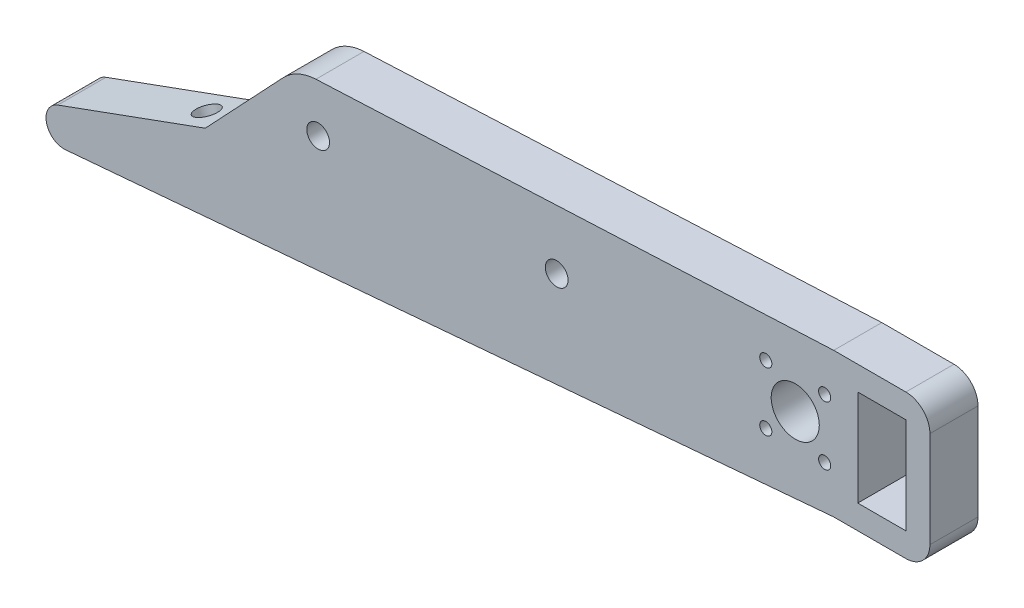
ISO-10303-21;
HEADER;
FILE_DESCRIPTION(('STEP AP214'),'2;1');
FILE_NAME('part.step','',(''),(''),'','','');
FILE_SCHEMA(('AUTOMOTIVE_DESIGN { 1 0 10303 214 1 1 1 1 }'));
ENDSEC;
DATA;
#1=APPLICATION_CONTEXT('core data for automotive mechanical design processes');
#2=APPLICATION_PROTOCOL_DEFINITION('international standard','automotive_design',2000,#1);
#3=PRODUCT_CONTEXT('',#1,'mechanical');
#4=PRODUCT('Part','Part','',(#3));
#5=PRODUCT_RELATED_PRODUCT_CATEGORY('part','',(#4));
#6=PRODUCT_DEFINITION_FORMATION('','',#4);
#7=PRODUCT_DEFINITION_CONTEXT('part definition',#1,'design');
#8=PRODUCT_DEFINITION('design','',#6,#7);
#9=PRODUCT_DEFINITION_SHAPE('','',#8);
#10=(LENGTH_UNIT() NAMED_UNIT(*) SI_UNIT(.MILLI.,.METRE.));
#11=(NAMED_UNIT(*) PLANE_ANGLE_UNIT() SI_UNIT($,.RADIAN.));
#12=(NAMED_UNIT(*) SI_UNIT($,.STERADIAN.) SOLID_ANGLE_UNIT());
#13=UNCERTAINTY_MEASURE_WITH_UNIT(LENGTH_MEASURE(1.E-05),#10,'distance_accuracy_value','');
#14=(GEOMETRIC_REPRESENTATION_CONTEXT(3) GLOBAL_UNCERTAINTY_ASSIGNED_CONTEXT((#13)) GLOBAL_UNIT_ASSIGNED_CONTEXT((#10,
#11,#12)) REPRESENTATION_CONTEXT('',''));
#15=CARTESIAN_POINT('',(0.,0.,0.));
#16=DIRECTION('',(0.,0.,1.));
#17=DIRECTION('',(1.,0.,0.));
#18=AXIS2_PLACEMENT_3D('',#15,#16,#17);
#19=CARTESIAN_POINT('',(-3.31854904900146,9.11763857748431,3.175));
#20=DIRECTION('',(0.342020143325663,-0.93969262078591,0.));
#21=DIRECTION('',(0.939692620785911,0.342020143325663,0.));
#22=AXIS2_PLACEMENT_3D('',#19,#20,#21);
#23=PLANE('',#22);
#24=CARTESIAN_POINT('',(-49.3814972545497,-7.64790347188071,0.));
#25=DIRECTION('',(-0.342020143325663,0.939692620785911,0.));
#26=DIRECTION('',(-0.939692620785911,-0.342020143325663,0.));
#27=AXIS2_PLACEMENT_3D('',#24,#25,#26);
#28=CIRCLE('',#27,1.5);
#29=CARTESIAN_POINT('',(-50.7910361857286,-8.16093368686921,0.));
#30=VERTEX_POINT('',#29);
#31=EDGE_CURVE('E541',#30,#30,#28,.T.);
#32=ORIENTED_EDGE('',*,*,#31,.F.);
#33=EDGE_LOOP('',(#32));
#34=FACE_BOUND('',#33,.T.);
#35=DIRECTION('',(-0.939692620785911,-0.342020143325663,0.));
#36=VECTOR('',#35,1.);
#37=CARTESIAN_POINT('',(-3.31854904900146,9.11763857748431,-3.175));
#38=LINE('',#37,#36);
#39=CARTESIAN_POINT('',(-46.3979731835544,-6.56198951682173,-3.175));
#40=VERTEX_POINT('',#39);
#41=CARTESIAN_POINT('',(-65.8614966392591,-13.6461327086401,-3.175));
#42=VERTEX_POINT('',#41);
#43=EDGE_CURVE('E273',#40,#42,#38,.T.);
#44=ORIENTED_EDGE('',*,*,#43,.T.);
#45=DIRECTION('',(0.,0.,-1.));
#46=VECTOR('',#45,1.);
#47=CARTESIAN_POINT('',(-65.8614966392591,-13.6461327086401,3.175));
#48=LINE('',#47,#46);
#49=CARTESIAN_POINT('',(-65.8614966392591,-13.6461327086401,3.175));
#50=VERTEX_POINT('',#49);
#51=EDGE_CURVE('E186',#50,#42,#48,.T.);
#52=ORIENTED_EDGE('',*,*,#51,.F.);
#53=DIRECTION('',(-0.939692620785911,-0.342020143325663,0.));
#54=VECTOR('',#53,1.);
#55=CARTESIAN_POINT('',(-3.31854904900146,9.11763857748431,3.175));
#56=LINE('',#55,#54);
#57=CARTESIAN_POINT('',(-46.3979731835544,-6.56198951682173,3.175));
#58=VERTEX_POINT('',#57);
#59=EDGE_CURVE('E287',#58,#50,#56,.T.);
#60=ORIENTED_EDGE('',*,*,#59,.F.);
#61=DIRECTION('',(0.,0.,-1.));
#62=VECTOR('',#61,1.);
#63=CARTESIAN_POINT('',(-46.3979731835544,-6.56198951682173,3.175));
#64=LINE('',#63,#62);
#65=EDGE_CURVE('E174',#58,#40,#64,.T.);
#66=ORIENTED_EDGE('',*,*,#65,.T.);
#67=EDGE_LOOP('',(#44,#52,#60,#66));
#68=FACE_BOUND('',#67,.T.);
#69=ADVANCED_FACE('F37',(#34,#68),#23,.F.);
#70=CARTESIAN_POINT('',(-65.0470611729648,-15.8837757618866,3.175));
#71=DIRECTION('',(0.,0.,-1.));
#72=DIRECTION('',(-1.,0.,0.));
#73=AXIS2_PLACEMENT_3D('',#70,#71,#72);
#74=CYLINDRICAL_SURFACE('',#73,2.38125);
#75=CARTESIAN_POINT('',(-65.0470611729648,-15.8837757618866,-3.175));
#76=DIRECTION('',(0.,0.,1.));
#77=DIRECTION('',(1.,0.,0.));
#78=AXIS2_PLACEMENT_3D('',#75,#76,#77);
#79=CIRCLE('',#78,2.38125);
#80=CARTESIAN_POINT('',(-64.8428124226916,-18.25625,-3.175));
#81=VERTEX_POINT('',#80);
#82=EDGE_CURVE('E222',#42,#81,#79,.T.);
#83=ORIENTED_EDGE('',*,*,#82,.T.);
#84=DIRECTION('',(0.,0.,-1.));
#85=VECTOR('',#84,1.);
#86=CARTESIAN_POINT('',(-64.8428124226916,-18.25625,3.175));
#87=LINE('',#86,#85);
#88=CARTESIAN_POINT('',(-64.8428124226916,-18.25625,3.175));
#89=VERTEX_POINT('',#88);
#90=EDGE_CURVE('E243',#89,#81,#87,.T.);
#91=ORIENTED_EDGE('',*,*,#90,.F.);
#92=CARTESIAN_POINT('',(-65.0470611729648,-15.8837757618866,3.175));
#93=DIRECTION('',(0.,0.,1.));
#94=DIRECTION('',(1.,0.,0.));
#95=AXIS2_PLACEMENT_3D('',#92,#93,#94);
#96=CIRCLE('',#95,2.38125);
#97=EDGE_CURVE('E284',#50,#89,#96,.T.);
#98=ORIENTED_EDGE('',*,*,#97,.F.);
#99=ORIENTED_EDGE('',*,*,#51,.T.);
#100=EDGE_LOOP('',(#83,#91,#98,#99));
#101=FACE_BOUND('',#100,.T.);
#102=ADVANCED_FACE('F277',(#101),#74,.T.);
#103=CARTESIAN_POINT('',(1.08307871550591,-12.5806221430956,3.175));
#104=DIRECTION('',(-0.0857737533955733,0.99631464067755,0.));
#105=DIRECTION('',(-0.99631464067755,-0.0857737533955733,0.));
#106=AXIS2_PLACEMENT_3D('',#103,#104,#105);
#107=PLANE('',#106);
#108=DIRECTION('',(0.99631464067755,0.0857737533955733,0.));
#109=VECTOR('',#108,1.);
#110=CARTESIAN_POINT('',(1.08307871550591,-12.5806221430956,-3.175));
#111=LINE('',#110,#109);
#112=CARTESIAN_POINT('',(36.576,-9.525,-3.175));
#113=VERTEX_POINT('',#112);
#114=EDGE_CURVE('E218',#81,#113,#111,.T.);
#115=ORIENTED_EDGE('',*,*,#114,.T.);
#116=DIRECTION('',(0.,0.,-1.));
#117=VECTOR('',#116,1.);
#118=CARTESIAN_POINT('',(36.576,-9.525,3.175));
#119=LINE('',#118,#117);
#120=CARTESIAN_POINT('',(36.576,-9.525,3.175));
#121=VERTEX_POINT('',#120);
#122=EDGE_CURVE('E217',#121,#113,#119,.T.);
#123=ORIENTED_EDGE('',*,*,#122,.F.);
#124=DIRECTION('',(0.99631464067755,0.0857737533955733,0.));
#125=VECTOR('',#124,1.);
#126=CARTESIAN_POINT('',(1.08307871550591,-12.5806221430956,3.175));
#127=LINE('',#126,#125);
#128=EDGE_CURVE('E283',#89,#121,#127,.T.);
#129=ORIENTED_EDGE('',*,*,#128,.F.);
#130=ORIENTED_EDGE('',*,*,#90,.T.);
#131=EDGE_LOOP('',(#115,#123,#129,#130));
#132=FACE_BOUND('',#131,.T.);
#133=ADVANCED_FACE('F282',(#132),#107,.F.);
#134=CARTESIAN_POINT('',(0.,-9.52500000000001,3.175));
#135=DIRECTION('',(0.,1.,0.));
#136=DIRECTION('',(-1.,0.,0.));
#137=AXIS2_PLACEMENT_3D('',#134,#135,#136);
#138=PLANE('',#137);
#139=DIRECTION('',(1.,0.,0.));
#140=VECTOR('',#139,1.);
#141=CARTESIAN_POINT('',(0.,-9.52500000000001,-3.175));
#142=LINE('',#141,#140);
#143=CARTESIAN_POINT('',(46.101,-9.525,-3.175));
#144=VERTEX_POINT('',#143);
#145=EDGE_CURVE('E212',#113,#144,#142,.T.);
#146=ORIENTED_EDGE('',*,*,#145,.T.);
#147=DIRECTION('',(0.,0.,-1.));
#148=VECTOR('',#147,1.);
#149=CARTESIAN_POINT('',(46.101,-9.525,3.175));
#150=LINE('',#149,#148);
#151=CARTESIAN_POINT('',(46.101,-9.525,3.175));
#152=VERTEX_POINT('',#151);
#153=EDGE_CURVE('E60',#144,#152,#150,.F.);
#154=ORIENTED_EDGE('',*,*,#153,.T.);
#155=DIRECTION('',(1.,0.,0.));
#156=VECTOR('',#155,1.);
#157=CARTESIAN_POINT('',(0.,-9.52500000000001,3.175));
#158=LINE('',#157,#156);
#159=EDGE_CURVE('E197',#121,#152,#158,.T.);
#160=ORIENTED_EDGE('',*,*,#159,.F.);
#161=ORIENTED_EDGE('',*,*,#122,.T.);
#162=EDGE_LOOP('',(#146,#154,#160,#161));
#163=FACE_BOUND('',#162,.T.);
#164=ADVANCED_FACE('F215',(#163),#138,.F.);
#165=CARTESIAN_POINT('',(49.276,0.,3.175));
#166=DIRECTION('',(1.,0.,0.));
#167=DIRECTION('',(0.,0.,-1.));
#168=AXIS2_PLACEMENT_3D('',#165,#166,#167);
#169=PLANE('',#168);
#170=DIRECTION('',(0.,-1.,0.));
#171=VECTOR('',#170,1.);
#172=CARTESIAN_POINT('',(49.276,0.,3.175));
#173=LINE('',#172,#171);
#174=CARTESIAN_POINT('',(49.276,6.35,3.175));
#175=VERTEX_POINT('',#174);
#176=CARTESIAN_POINT('',(49.276,-6.35,3.175));
#177=VERTEX_POINT('',#176);
#178=EDGE_CURVE('E196',#175,#177,#173,.T.);
#179=ORIENTED_EDGE('',*,*,#178,.T.);
#180=DIRECTION('',(0.,0.,-1.));
#181=VECTOR('',#180,1.);
#182=CARTESIAN_POINT('',(49.276,-6.35,-3.175));
#183=LINE('',#182,#181);
#184=CARTESIAN_POINT('',(49.276,-6.35,-3.175));
#185=VERTEX_POINT('',#184);
#186=EDGE_CURVE('E185',#177,#185,#183,.T.);
#187=ORIENTED_EDGE('',*,*,#186,.T.);
#188=DIRECTION('',(0.,-1.,0.));
#189=VECTOR('',#188,1.);
#190=CARTESIAN_POINT('',(49.276,0.,-3.175));
#191=LINE('',#190,#189);
#192=CARTESIAN_POINT('',(49.276,6.35,-3.175));
#193=VERTEX_POINT('',#192);
#194=EDGE_CURVE('E213',#193,#185,#191,.T.);
#195=ORIENTED_EDGE('',*,*,#194,.F.);
#196=DIRECTION('',(0.,0.,-1.));
#197=VECTOR('',#196,1.);
#198=CARTESIAN_POINT('',(49.276,6.35,3.175));
#199=LINE('',#198,#197);
#200=EDGE_CURVE('E183',#193,#175,#199,.F.);
#201=ORIENTED_EDGE('',*,*,#200,.T.);
#202=EDGE_LOOP('',(#179,#187,#195,#201));
#203=FACE_BOUND('',#202,.T.);
#204=ADVANCED_FACE('F201',(#203),#169,.T.);
#205=CARTESIAN_POINT('',(0.,9.525,3.175));
#206=DIRECTION('',(0.,1.,0.));
#207=DIRECTION('',(0.,0.,1.));
#208=AXIS2_PLACEMENT_3D('',#205,#206,#207);
#209=PLANE('',#208);
#210=DIRECTION('',(1.,0.,0.));
#211=VECTOR('',#210,1.);
#212=CARTESIAN_POINT('',(0.,9.525,3.175));
#213=LINE('',#212,#211);
#214=CARTESIAN_POINT('',(36.576,9.525,3.175));
#215=VERTEX_POINT('',#214);
#216=CARTESIAN_POINT('',(46.101,9.525,3.175));
#217=VERTEX_POINT('',#216);
#218=EDGE_CURVE('E205',#215,#217,#213,.T.);
#219=ORIENTED_EDGE('',*,*,#218,.T.);
#220=DIRECTION('',(0.,0.,-1.));
#221=VECTOR('',#220,1.);
#222=CARTESIAN_POINT('',(46.101,9.525,3.175));
#223=LINE('',#222,#221);
#224=CARTESIAN_POINT('',(46.101,9.525,-3.175));
#225=VERTEX_POINT('',#224);
#226=EDGE_CURVE('E11',#217,#225,#223,.T.);
#227=ORIENTED_EDGE('',*,*,#226,.T.);
#228=DIRECTION('',(1.,0.,0.));
#229=VECTOR('',#228,1.);
#230=CARTESIAN_POINT('',(0.,9.525,-3.175));
#231=LINE('',#230,#229);
#232=CARTESIAN_POINT('',(36.576,9.525,-3.175));
#233=VERTEX_POINT('',#232);
#234=EDGE_CURVE('E220',#233,#225,#231,.T.);
#235=ORIENTED_EDGE('',*,*,#234,.F.);
#236=DIRECTION('',(0.,0.,-1.));
#237=VECTOR('',#236,1.);
#238=CARTESIAN_POINT('',(36.576,9.525,3.175));
#239=LINE('',#238,#237);
#240=EDGE_CURVE('E240',#215,#233,#239,.T.);
#241=ORIENTED_EDGE('',*,*,#240,.F.);
#242=EDGE_LOOP('',(#219,#227,#235,#241));
#243=FACE_BOUND('',#242,.T.);
#244=ADVANCED_FACE('F364',(#243),#209,.T.);
#245=CARTESIAN_POINT('',(-0.363289023984433,7.80581529648143,3.175));
#246=DIRECTION('',(0.046490494272575,-0.998918732401336,0.));
#247=DIRECTION('',(0.998918732401336,0.046490494272575,0.));
#248=AXIS2_PLACEMENT_3D('',#245,#246,#247);
#249=PLANE('',#248);
#250=DIRECTION('',(-0.998918732401336,-0.046490494272575,0.));
#251=VECTOR('',#250,1.);
#252=CARTESIAN_POINT('',(-0.363289023984433,7.80581529648143,-3.175));
#253=LINE('',#252,#251);
#254=CARTESIAN_POINT('',(-31.7912146386308,6.34313395074848,-3.175));
#255=VERTEX_POINT('',#254);
#256=EDGE_CURVE('E228',#233,#255,#253,.T.);
#257=ORIENTED_EDGE('',*,*,#256,.T.);
#258=DIRECTION('',(0.,0.,-1.));
#259=VECTOR('',#258,1.);
#260=CARTESIAN_POINT('',(-31.7912146386308,6.34313395074848,3.175));
#261=LINE('',#260,#259);
#262=CARTESIAN_POINT('',(-31.7912146386308,6.34313395074848,3.175));
#263=VERTEX_POINT('',#262);
#264=EDGE_CURVE('E237',#263,#255,#261,.T.);
#265=ORIENTED_EDGE('',*,*,#264,.F.);
#266=DIRECTION('',(-0.998918732401336,-0.046490494272575,0.));
#267=VECTOR('',#266,1.);
#268=CARTESIAN_POINT('',(-0.363289023984433,7.80581529648143,3.175));
#269=LINE('',#268,#267);
#270=EDGE_CURVE('E292',#215,#263,#269,.T.);
#271=ORIENTED_EDGE('',*,*,#270,.F.);
#272=ORIENTED_EDGE('',*,*,#240,.T.);
#273=EDGE_LOOP('',(#257,#265,#271,#272));
#274=FACE_BOUND('',#273,.T.);
#275=ADVANCED_FACE('F358',(#274),#249,.F.);
#276=CARTESIAN_POINT('',(-31.496,0.,3.175));
#277=DIRECTION('',(0.,0.,-1.));
#278=DIRECTION('',(-1.,0.,0.));
#279=AXIS2_PLACEMENT_3D('',#276,#277,#278);
#280=CYLINDRICAL_SURFACE('',#279,6.35);
#281=CARTESIAN_POINT('',(-31.496,0.,-3.175));
#282=DIRECTION('',(0.,0.,1.));
#283=DIRECTION('',(1.,0.,0.));
#284=AXIS2_PLACEMENT_3D('',#281,#282,#283);
#285=CIRCLE('',#284,6.35);
#286=CARTESIAN_POINT('',(-36.1188329423087,4.35337978902663,-3.175));
#287=VERTEX_POINT('',#286);
#288=EDGE_CURVE('E230',#255,#287,#285,.T.);
#289=ORIENTED_EDGE('',*,*,#288,.T.);
#290=DIRECTION('',(0.,0.,-1.));
#291=VECTOR('',#290,1.);
#292=CARTESIAN_POINT('',(-36.1188329423087,4.35337978902663,3.175));
#293=LINE('',#292,#291);
#294=CARTESIAN_POINT('',(-36.1188329423087,4.35337978902663,3.175));
#295=VERTEX_POINT('',#294);
#296=EDGE_CURVE('E177',#295,#287,#293,.T.);
#297=ORIENTED_EDGE('',*,*,#296,.F.);
#298=CARTESIAN_POINT('',(-31.496,0.,3.175));
#299=DIRECTION('',(0.,0.,1.));
#300=DIRECTION('',(1.,0.,0.));
#301=AXIS2_PLACEMENT_3D('',#298,#299,#300);
#302=CIRCLE('',#301,6.35);
#303=EDGE_CURVE('E294',#263,#295,#302,.T.);
#304=ORIENTED_EDGE('',*,*,#303,.F.);
#305=ORIENTED_EDGE('',*,*,#264,.T.);
#306=EDGE_LOOP('',(#289,#297,#304,#305));
#307=FACE_BOUND('',#306,.T.);
#308=ADVANCED_FACE('F354',(#307),#280,.T.);
#309=CARTESIAN_POINT('',(0.,6.35,3.175));
#310=DIRECTION('',(0.,1.,0.));
#311=DIRECTION('',(0.,0.,1.));
#312=AXIS2_PLACEMENT_3D('',#309,#310,#311);
#313=PLANE('',#312);
#314=DIRECTION('',(1.,0.,0.));
#315=VECTOR('',#314,1.);
#316=CARTESIAN_POINT('',(0.,6.35,-3.175));
#317=LINE('',#316,#315);
#318=CARTESIAN_POINT('',(39.751,6.35,-3.175));
#319=VERTEX_POINT('',#318);
#320=CARTESIAN_POINT('',(46.101,6.35,-3.175));
#321=VERTEX_POINT('',#320);
#322=EDGE_CURVE('E173',#319,#321,#317,.T.);
#323=ORIENTED_EDGE('',*,*,#322,.T.);
#324=DIRECTION('',(0.,0.,-1.));
#325=VECTOR('',#324,1.);
#326=CARTESIAN_POINT('',(46.101,6.35,3.175));
#327=LINE('',#326,#325);
#328=CARTESIAN_POINT('',(46.101,6.35,3.175));
#329=VERTEX_POINT('',#328);
#330=EDGE_CURVE('E153',#329,#321,#327,.T.);
#331=ORIENTED_EDGE('',*,*,#330,.F.);
#332=DIRECTION('',(1.,0.,0.));
#333=VECTOR('',#332,1.);
#334=CARTESIAN_POINT('',(0.,6.35,3.175));
#335=LINE('',#334,#333);
#336=CARTESIAN_POINT('',(39.751,6.35,3.175));
#337=VERTEX_POINT('',#336);
#338=EDGE_CURVE('E160',#337,#329,#335,.T.);
#339=ORIENTED_EDGE('',*,*,#338,.F.);
#340=DIRECTION('',(0.,0.,-1.));
#341=VECTOR('',#340,1.);
#342=CARTESIAN_POINT('',(39.751,6.35,3.175));
#343=LINE('',#342,#341);
#344=EDGE_CURVE('E248',#337,#319,#343,.T.);
#345=ORIENTED_EDGE('',*,*,#344,.T.);
#346=EDGE_LOOP('',(#323,#331,#339,#345));
#347=FACE_BOUND('',#346,.T.);
#348=ADVANCED_FACE('F171',(#347),#313,.F.);
#349=CARTESIAN_POINT('',(46.101,0.,3.175));
#350=DIRECTION('',(1.,0.,0.));
#351=DIRECTION('',(0.,0.,-1.));
#352=AXIS2_PLACEMENT_3D('',#349,#350,#351);
#353=PLANE('',#352);
#354=DIRECTION('',(0.,-1.,0.));
#355=VECTOR('',#354,1.);
#356=CARTESIAN_POINT('',(46.101,0.,-3.175));
#357=LINE('',#356,#355);
#358=CARTESIAN_POINT('',(46.101,-6.35,-3.175));
#359=VERTEX_POINT('',#358);
#360=EDGE_CURVE('E261',#321,#359,#357,.T.);
#361=ORIENTED_EDGE('',*,*,#360,.T.);
#362=DIRECTION('',(0.,0.,-1.));
#363=VECTOR('',#362,1.);
#364=CARTESIAN_POINT('',(46.101,-6.35,3.175));
#365=LINE('',#364,#363);
#366=CARTESIAN_POINT('',(46.101,-6.35,3.175));
#367=VERTEX_POINT('',#366);
#368=EDGE_CURVE('E155',#367,#359,#365,.T.);
#369=ORIENTED_EDGE('',*,*,#368,.F.);
#370=DIRECTION('',(0.,-1.,0.));
#371=VECTOR('',#370,1.);
#372=CARTESIAN_POINT('',(46.101,0.,3.175));
#373=LINE('',#372,#371);
#374=EDGE_CURVE('E148',#329,#367,#373,.T.);
#375=ORIENTED_EDGE('',*,*,#374,.F.);
#376=ORIENTED_EDGE('',*,*,#330,.T.);
#377=EDGE_LOOP('',(#361,#369,#375,#376));
#378=FACE_BOUND('',#377,.T.);
#379=ADVANCED_FACE('F151',(#378),#353,.F.);
#380=CARTESIAN_POINT('',(0.,-6.34999999999999,3.175));
#381=DIRECTION('',(0.,1.,0.));
#382=DIRECTION('',(-1.,0.,0.));
#383=AXIS2_PLACEMENT_3D('',#380,#381,#382);
#384=PLANE('',#383);
#385=DIRECTION('',(1.,0.,0.));
#386=VECTOR('',#385,1.);
#387=CARTESIAN_POINT('',(0.,-6.34999999999999,-3.175));
#388=LINE('',#387,#386);
#389=CARTESIAN_POINT('',(39.751,-6.35,-3.175));
#390=VERTEX_POINT('',#389);
#391=EDGE_CURVE('E258',#390,#359,#388,.T.);
#392=ORIENTED_EDGE('',*,*,#391,.F.);
#393=DIRECTION('',(0.,0.,-1.));
#394=VECTOR('',#393,1.);
#395=CARTESIAN_POINT('',(39.751,-6.35,3.175));
#396=LINE('',#395,#394);
#397=CARTESIAN_POINT('',(39.751,-6.35,3.175));
#398=VERTEX_POINT('',#397);
#399=EDGE_CURVE('E179',#398,#390,#396,.T.);
#400=ORIENTED_EDGE('',*,*,#399,.F.);
#401=DIRECTION('',(1.,0.,0.));
#402=VECTOR('',#401,1.);
#403=CARTESIAN_POINT('',(0.,-6.34999999999999,3.175));
#404=LINE('',#403,#402);
#405=EDGE_CURVE('E159',#398,#367,#404,.T.);
#406=ORIENTED_EDGE('',*,*,#405,.T.);
#407=ORIENTED_EDGE('',*,*,#368,.T.);
#408=EDGE_LOOP('',(#392,#400,#406,#407));
#409=FACE_BOUND('',#408,.T.);
#410=ADVANCED_FACE('F259',(#409),#384,.T.);
#411=CARTESIAN_POINT('',(27.606912703474,-3.88908729652599,3.175));
#412=DIRECTION('',(0.,0.,-1.));
#413=DIRECTION('',(-1.,0.,0.));
#414=AXIS2_PLACEMENT_3D('',#411,#412,#413);
#415=CYLINDRICAL_SURFACE('',#414,0.800000000000003);
#416=CARTESIAN_POINT('',(27.606912703474,-3.88908729652599,3.175));
#417=DIRECTION('',(0.,0.,1.));
#418=DIRECTION('',(1.,0.,0.));
#419=AXIS2_PLACEMENT_3D('',#416,#417,#418);
#420=CIRCLE('',#419,0.800000000000003);
#421=CARTESIAN_POINT('',(28.406912703474,-3.88908729652599,3.175));
#422=VERTEX_POINT('',#421);
#423=EDGE_CURVE('E563',#422,#422,#420,.T.);
#424=ORIENTED_EDGE('',*,*,#423,.T.);
#425=EDGE_LOOP('',(#424));
#426=FACE_BOUND('',#425,.T.);
#427=CARTESIAN_POINT('',(27.606912703474,-3.88908729652599,-3.175));
#428=DIRECTION('',(0.,0.,1.));
#429=DIRECTION('',(1.,0.,0.));
#430=AXIS2_PLACEMENT_3D('',#427,#428,#429);
#431=CIRCLE('',#430,0.800000000000003);
#432=CARTESIAN_POINT('',(28.406912703474,-3.88908729652599,-3.175));
#433=VERTEX_POINT('',#432);
#434=EDGE_CURVE('E267',#433,#433,#431,.T.);
#435=ORIENTED_EDGE('',*,*,#434,.F.);
#436=EDGE_LOOP('',(#435));
#437=FACE_BOUND('',#436,.T.);
#438=ADVANCED_FACE('F343',(#426,#437),#415,.F.);
#439=CARTESIAN_POINT('',(35.385087296526,3.88908729652601,3.175));
#440=DIRECTION('',(0.,0.,-1.));
#441=DIRECTION('',(-1.,0.,0.));
#442=AXIS2_PLACEMENT_3D('',#439,#440,#441);
#443=CYLINDRICAL_SURFACE('',#442,0.80000000000001);
#444=CARTESIAN_POINT('',(35.385087296526,3.88908729652601,3.175));
#445=DIRECTION('',(0.,0.,1.));
#446=DIRECTION('',(1.,0.,0.));
#447=AXIS2_PLACEMENT_3D('',#444,#445,#446);
#448=CIRCLE('',#447,0.80000000000001);
#449=CARTESIAN_POINT('',(36.185087296526,3.88908729652601,3.175));
#450=VERTEX_POINT('',#449);
#451=EDGE_CURVE('E560',#450,#450,#448,.T.);
#452=ORIENTED_EDGE('',*,*,#451,.T.);
#453=EDGE_LOOP('',(#452));
#454=FACE_BOUND('',#453,.T.);
#455=CARTESIAN_POINT('',(35.385087296526,3.88908729652601,-3.175));
#456=DIRECTION('',(0.,0.,1.));
#457=DIRECTION('',(1.,0.,0.));
#458=AXIS2_PLACEMENT_3D('',#455,#456,#457);
#459=CIRCLE('',#458,0.80000000000001);
#460=CARTESIAN_POINT('',(36.185087296526,3.88908729652601,-3.175));
#461=VERTEX_POINT('',#460);
#462=EDGE_CURVE('E264',#461,#461,#459,.T.);
#463=ORIENTED_EDGE('',*,*,#462,.F.);
#464=EDGE_LOOP('',(#463));
#465=FACE_BOUND('',#464,.T.);
#466=ADVANCED_FACE('F328',(#454,#465),#443,.F.);
#467=CARTESIAN_POINT('',(39.751,0.,3.175));
#468=DIRECTION('',(1.,0.,0.));
#469=DIRECTION('',(0.,0.,-1.));
#470=AXIS2_PLACEMENT_3D('',#467,#468,#469);
#471=PLANE('',#470);
#472=DIRECTION('',(0.,-1.,0.));
#473=VECTOR('',#472,1.);
#474=CARTESIAN_POINT('',(39.751,0.,-3.175));
#475=LINE('',#474,#473);
#476=EDGE_CURVE('E255',#319,#390,#475,.T.);
#477=ORIENTED_EDGE('',*,*,#476,.F.);
#478=ORIENTED_EDGE('',*,*,#344,.F.);
#479=DIRECTION('',(0.,-1.,0.));
#480=VECTOR('',#479,1.);
#481=CARTESIAN_POINT('',(39.751,0.,3.175));
#482=LINE('',#481,#480);
#483=EDGE_CURVE('E167',#337,#398,#482,.T.);
#484=ORIENTED_EDGE('',*,*,#483,.T.);
#485=ORIENTED_EDGE('',*,*,#399,.T.);
#486=EDGE_LOOP('',(#477,#478,#484,#485));
#487=FACE_BOUND('',#486,.T.);
#488=ADVANCED_FACE('F253',(#487),#471,.T.);
#489=CARTESIAN_POINT('',(31.496,0.,3.175));
#490=DIRECTION('',(0.,0.,-1.));
#491=DIRECTION('',(-1.,0.,0.));
#492=AXIS2_PLACEMENT_3D('',#489,#490,#491);
#493=CYLINDRICAL_SURFACE('',#492,3.17500000000001);
#494=CARTESIAN_POINT('',(31.496,0.,3.175));
#495=DIRECTION('',(0.,0.,1.));
#496=DIRECTION('',(1.,0.,0.));
#497=AXIS2_PLACEMENT_3D('',#494,#495,#496);
#498=CIRCLE('',#497,3.17500000000001);
#499=CARTESIAN_POINT('',(34.671,0.,3.175));
#500=VERTEX_POINT('',#499);
#501=EDGE_CURVE('E169',#500,#500,#498,.T.);
#502=ORIENTED_EDGE('',*,*,#501,.T.);
#503=EDGE_LOOP('',(#502));
#504=FACE_BOUND('',#503,.T.);
#505=CARTESIAN_POINT('',(31.496,0.,-3.175));
#506=DIRECTION('',(0.,0.,1.));
#507=DIRECTION('',(1.,0.,0.));
#508=AXIS2_PLACEMENT_3D('',#505,#506,#507);
#509=CIRCLE('',#508,3.17500000000001);
#510=CARTESIAN_POINT('',(34.671,0.,-3.175));
#511=VERTEX_POINT('',#510);
#512=EDGE_CURVE('E310',#511,#511,#509,.T.);
#513=ORIENTED_EDGE('',*,*,#512,.F.);
#514=EDGE_LOOP('',(#513));
#515=FACE_BOUND('',#514,.T.);
#516=ADVANCED_FACE('F316',(#504,#515),#493,.F.);
#517=CARTESIAN_POINT('',(27.606912703474,3.88908729652603,3.175));
#518=DIRECTION('',(0.,0.,-1.));
#519=DIRECTION('',(-1.,0.,0.));
#520=AXIS2_PLACEMENT_3D('',#517,#518,#519);
#521=CYLINDRICAL_SURFACE('',#520,0.800000000000003);
#522=CARTESIAN_POINT('',(27.606912703474,3.88908729652603,3.175));
#523=DIRECTION('',(0.,0.,1.));
#524=DIRECTION('',(1.,0.,0.));
#525=AXIS2_PLACEMENT_3D('',#522,#523,#524);
#526=CIRCLE('',#525,0.800000000000003);
#527=CARTESIAN_POINT('',(28.406912703474,3.88908729652603,3.175));
#528=VERTEX_POINT('',#527);
#529=EDGE_CURVE('E554',#528,#528,#526,.T.);
#530=ORIENTED_EDGE('',*,*,#529,.T.);
#531=EDGE_LOOP('',(#530));
#532=FACE_BOUND('',#531,.T.);
#533=CARTESIAN_POINT('',(27.606912703474,3.88908729652603,-3.175));
#534=DIRECTION('',(0.,0.,1.));
#535=DIRECTION('',(1.,0.,0.));
#536=AXIS2_PLACEMENT_3D('',#533,#534,#535);
#537=CIRCLE('',#536,0.800000000000003);
#538=CARTESIAN_POINT('',(28.406912703474,3.88908729652603,-3.175));
#539=VERTEX_POINT('',#538);
#540=EDGE_CURVE('E307',#539,#539,#537,.T.);
#541=ORIENTED_EDGE('',*,*,#540,.F.);
#542=EDGE_LOOP('',(#541));
#543=FACE_BOUND('',#542,.T.);
#544=ADVANCED_FACE('F318',(#532,#543),#521,.F.);
#545=CARTESIAN_POINT('',(35.385087296526,-3.88908729652601,3.175));
#546=DIRECTION('',(0.,0.,-1.));
#547=DIRECTION('',(-1.,0.,0.));
#548=AXIS2_PLACEMENT_3D('',#545,#546,#547);
#549=CYLINDRICAL_SURFACE('',#548,0.800000000000003);
#550=CARTESIAN_POINT('',(35.385087296526,-3.88908729652601,3.175));
#551=DIRECTION('',(0.,0.,1.));
#552=DIRECTION('',(1.,0.,0.));
#553=AXIS2_PLACEMENT_3D('',#550,#551,#552);
#554=CIRCLE('',#553,0.800000000000003);
#555=CARTESIAN_POINT('',(36.185087296526,-3.88908729652601,3.175));
#556=VERTEX_POINT('',#555);
#557=EDGE_CURVE('E551',#556,#556,#554,.T.);
#558=ORIENTED_EDGE('',*,*,#557,.T.);
#559=EDGE_LOOP('',(#558));
#560=FACE_BOUND('',#559,.T.);
#561=CARTESIAN_POINT('',(35.385087296526,-3.88908729652601,-3.175));
#562=DIRECTION('',(0.,0.,1.));
#563=DIRECTION('',(1.,0.,0.));
#564=AXIS2_PLACEMENT_3D('',#561,#562,#563);
#565=CIRCLE('',#564,0.800000000000003);
#566=CARTESIAN_POINT('',(36.185087296526,-3.88908729652601,-3.175));
#567=VERTEX_POINT('',#566);
#568=EDGE_CURVE('E304',#567,#567,#565,.T.);
#569=ORIENTED_EDGE('',*,*,#568,.F.);
#570=EDGE_LOOP('',(#569));
#571=FACE_BOUND('',#570,.T.);
#572=ADVANCED_FACE('F325',(#560,#571),#549,.F.);
#573=CARTESIAN_POINT('',(-31.496,0.,3.175));
#574=DIRECTION('',(0.,0.,-1.));
#575=DIRECTION('',(-1.,0.,0.));
#576=AXIS2_PLACEMENT_3D('',#573,#574,#575);
#577=CYLINDRICAL_SURFACE('',#576,1.499997);
#578=CARTESIAN_POINT('',(-31.496,0.,3.175));
#579=DIRECTION('',(0.,0.,1.));
#580=DIRECTION('',(1.,0.,0.));
#581=AXIS2_PLACEMENT_3D('',#578,#579,#580);
#582=CIRCLE('',#581,1.499997);
#583=CARTESIAN_POINT('',(-29.996003,0.,3.175));
#584=VERTEX_POINT('',#583);
#585=EDGE_CURVE('E548',#584,#584,#582,.F.);
#586=ORIENTED_EDGE('',*,*,#585,.F.);
#587=EDGE_LOOP('',(#586));
#588=FACE_BOUND('',#587,.T.);
#589=CARTESIAN_POINT('',(-31.496,0.,-3.175));
#590=DIRECTION('',(0.,0.,1.));
#591=DIRECTION('',(1.,0.,0.));
#592=AXIS2_PLACEMENT_3D('',#589,#590,#591);
#593=CIRCLE('',#592,1.499997);
#594=CARTESIAN_POINT('',(-29.996003,0.,-3.175));
#595=VERTEX_POINT('',#594);
#596=EDGE_CURVE('E300',#595,#595,#593,.F.);
#597=ORIENTED_EDGE('',*,*,#596,.T.);
#598=EDGE_LOOP('',(#597));
#599=FACE_BOUND('',#598,.T.);
#600=ADVANCED_FACE('F457',(#588,#599),#577,.F.);
#601=CARTESIAN_POINT('',(0.,0.,3.175));
#602=DIRECTION('',(0.,0.,-1.));
#603=DIRECTION('',(-1.,0.,0.));
#604=AXIS2_PLACEMENT_3D('',#601,#602,#603);
#605=CYLINDRICAL_SURFACE('',#604,1.499997);
#606=CARTESIAN_POINT('',(0.,0.,3.175));
#607=DIRECTION('',(0.,0.,1.));
#608=DIRECTION('',(1.,0.,0.));
#609=AXIS2_PLACEMENT_3D('',#606,#607,#608);
#610=CIRCLE('',#609,1.499997);
#611=CARTESIAN_POINT('',(1.499997,0.,3.175));
#612=VERTEX_POINT('',#611);
#613=EDGE_CURVE('E233',#612,#612,#610,.T.);
#614=ORIENTED_EDGE('',*,*,#613,.T.);
#615=EDGE_LOOP('',(#614));
#616=FACE_BOUND('',#615,.T.);
#617=CARTESIAN_POINT('',(0.,0.,-3.175));
#618=DIRECTION('',(0.,0.,1.));
#619=DIRECTION('',(1.,0.,0.));
#620=AXIS2_PLACEMENT_3D('',#617,#618,#619);
#621=CIRCLE('',#620,1.499997);
#622=CARTESIAN_POINT('',(1.499997,0.,-3.175));
#623=VERTEX_POINT('',#622);
#624=EDGE_CURVE('E297',#623,#623,#621,.T.);
#625=ORIENTED_EDGE('',*,*,#624,.F.);
#626=EDGE_LOOP('',(#625));
#627=FACE_BOUND('',#626,.T.);
#628=ADVANCED_FACE('F467',(#616,#627),#605,.F.);
#629=CARTESIAN_POINT('',(-21.3154469086036,20.0730238198144,3.175));
#630=DIRECTION('',(0.728005187765149,-0.685571620319154,0.));
#631=DIRECTION('',(0.685571620319154,0.728005187765149,0.));
#632=AXIS2_PLACEMENT_3D('',#629,#630,#631);
#633=PLANE('',#632);
#634=DIRECTION('',(-0.685571620319154,-0.728005187765149,0.));
#635=VECTOR('',#634,1.);
#636=CARTESIAN_POINT('',(-21.3154469086036,20.0730238198144,-3.175));
#637=LINE('',#636,#635);
#638=EDGE_CURVE('E232',#287,#40,#637,.T.);
#639=ORIENTED_EDGE('',*,*,#638,.T.);
#640=ORIENTED_EDGE('',*,*,#65,.F.);
#641=DIRECTION('',(-0.685571620319154,-0.728005187765149,0.));
#642=VECTOR('',#641,1.);
#643=CARTESIAN_POINT('',(-21.3154469086036,20.0730238198144,3.175));
#644=LINE('',#643,#642);
#645=EDGE_CURVE('E249',#295,#58,#644,.T.);
#646=ORIENTED_EDGE('',*,*,#645,.F.);
#647=ORIENTED_EDGE('',*,*,#296,.T.);
#648=EDGE_LOOP('',(#639,#640,#646,#647));
#649=FACE_BOUND('',#648,.T.);
#650=ADVANCED_FACE('F368',(#649),#633,.F.);
#651=CARTESIAN_POINT('',(0.,0.,3.175));
#652=DIRECTION('',(0.,0.,1.));
#653=DIRECTION('',(1.,0.,0.));
#654=AXIS2_PLACEMENT_3D('',#651,#652,#653);
#655=PLANE('',#654);
#656=ORIENTED_EDGE('',*,*,#613,.F.);
#657=EDGE_LOOP('',(#656));
#658=FACE_BOUND('',#657,.T.);
#659=ORIENTED_EDGE('',*,*,#585,.T.);
#660=EDGE_LOOP('',(#659));
#661=FACE_BOUND('',#660,.T.);
#662=ORIENTED_EDGE('',*,*,#557,.F.);
#663=EDGE_LOOP('',(#662));
#664=FACE_BOUND('',#663,.T.);
#665=ORIENTED_EDGE('',*,*,#529,.F.);
#666=EDGE_LOOP('',(#665));
#667=FACE_BOUND('',#666,.T.);
#668=ORIENTED_EDGE('',*,*,#501,.F.);
#669=EDGE_LOOP('',(#668));
#670=FACE_BOUND('',#669,.T.);
#671=ORIENTED_EDGE('',*,*,#338,.T.);
#672=ORIENTED_EDGE('',*,*,#374,.T.);
#673=ORIENTED_EDGE('',*,*,#405,.F.);
#674=ORIENTED_EDGE('',*,*,#483,.F.);
#675=EDGE_LOOP('',(#671,#672,#673,#674));
#676=FACE_BOUND('',#675,.T.);
#677=ORIENTED_EDGE('',*,*,#451,.F.);
#678=EDGE_LOOP('',(#677));
#679=FACE_BOUND('',#678,.T.);
#680=ORIENTED_EDGE('',*,*,#423,.F.);
#681=EDGE_LOOP('',(#680));
#682=FACE_BOUND('',#681,.T.);
#683=ORIENTED_EDGE('',*,*,#159,.T.);
#684=CARTESIAN_POINT('',(46.101,-6.35,3.175));
#685=DIRECTION('',(0.,0.,1.));
#686=DIRECTION('',(1.,0.,0.));
#687=AXIS2_PLACEMENT_3D('',#684,#685,#686);
#688=CIRCLE('',#687,3.175);
#689=EDGE_CURVE('E45',#152,#177,#688,.T.);
#690=ORIENTED_EDGE('',*,*,#689,.T.);
#691=ORIENTED_EDGE('',*,*,#178,.F.);
#692=CARTESIAN_POINT('',(46.101,6.35,3.175));
#693=DIRECTION('',(0.,0.,1.));
#694=DIRECTION('',(1.,0.,0.));
#695=AXIS2_PLACEMENT_3D('',#692,#693,#694);
#696=CIRCLE('',#695,3.175);
#697=EDGE_CURVE('E52',#175,#217,#696,.T.);
#698=ORIENTED_EDGE('',*,*,#697,.T.);
#699=ORIENTED_EDGE('',*,*,#218,.F.);
#700=ORIENTED_EDGE('',*,*,#270,.T.);
#701=ORIENTED_EDGE('',*,*,#303,.T.);
#702=ORIENTED_EDGE('',*,*,#645,.T.);
#703=ORIENTED_EDGE('',*,*,#59,.T.);
#704=ORIENTED_EDGE('',*,*,#97,.T.);
#705=ORIENTED_EDGE('',*,*,#128,.T.);
#706=EDGE_LOOP('',(#683,#690,#691,#698,#699,#700,#701,#702,#703,#704,#705));
#707=FACE_BOUND('',#706,.T.);
#708=ADVANCED_FACE('F164',(#658,#661,#664,#667,#670,#676,#679,#682,#707),#655,.T.);
#709=CARTESIAN_POINT('',(0.,0.,-3.175));
#710=DIRECTION('',(0.,0.,1.));
#711=DIRECTION('',(1.,0.,0.));
#712=AXIS2_PLACEMENT_3D('',#709,#710,#711);
#713=PLANE('',#712);
#714=ORIENTED_EDGE('',*,*,#624,.T.);
#715=EDGE_LOOP('',(#714));
#716=FACE_BOUND('',#715,.T.);
#717=ORIENTED_EDGE('',*,*,#596,.F.);
#718=EDGE_LOOP('',(#717));
#719=FACE_BOUND('',#718,.T.);
#720=ORIENTED_EDGE('',*,*,#568,.T.);
#721=EDGE_LOOP('',(#720));
#722=FACE_BOUND('',#721,.T.);
#723=ORIENTED_EDGE('',*,*,#540,.T.);
#724=EDGE_LOOP('',(#723));
#725=FACE_BOUND('',#724,.T.);
#726=ORIENTED_EDGE('',*,*,#512,.T.);
#727=EDGE_LOOP('',(#726));
#728=FACE_BOUND('',#727,.T.);
#729=ORIENTED_EDGE('',*,*,#322,.F.);
#730=ORIENTED_EDGE('',*,*,#476,.T.);
#731=ORIENTED_EDGE('',*,*,#391,.T.);
#732=ORIENTED_EDGE('',*,*,#360,.F.);
#733=EDGE_LOOP('',(#729,#730,#731,#732));
#734=FACE_BOUND('',#733,.T.);
#735=ORIENTED_EDGE('',*,*,#462,.T.);
#736=EDGE_LOOP('',(#735));
#737=FACE_BOUND('',#736,.T.);
#738=ORIENTED_EDGE('',*,*,#434,.T.);
#739=EDGE_LOOP('',(#738));
#740=FACE_BOUND('',#739,.T.);
#741=ORIENTED_EDGE('',*,*,#194,.T.);
#742=CARTESIAN_POINT('',(46.101,-6.35,-3.175));
#743=DIRECTION('',(0.,0.,1.));
#744=DIRECTION('',(1.,0.,0.));
#745=AXIS2_PLACEMENT_3D('',#742,#743,#744);
#746=CIRCLE('',#745,3.175);
#747=EDGE_CURVE('E191',#185,#144,#746,.F.);
#748=ORIENTED_EDGE('',*,*,#747,.T.);
#749=ORIENTED_EDGE('',*,*,#145,.F.);
#750=ORIENTED_EDGE('',*,*,#114,.F.);
#751=ORIENTED_EDGE('',*,*,#82,.F.);
#752=ORIENTED_EDGE('',*,*,#43,.F.);
#753=ORIENTED_EDGE('',*,*,#638,.F.);
#754=ORIENTED_EDGE('',*,*,#288,.F.);
#755=ORIENTED_EDGE('',*,*,#256,.F.);
#756=ORIENTED_EDGE('',*,*,#234,.T.);
#757=CARTESIAN_POINT('',(46.101,6.35,-3.175));
#758=DIRECTION('',(0.,0.,1.));
#759=DIRECTION('',(1.,0.,0.));
#760=AXIS2_PLACEMENT_3D('',#757,#758,#759);
#761=CIRCLE('',#760,3.175);
#762=EDGE_CURVE('E189',#225,#193,#761,.F.);
#763=ORIENTED_EDGE('',*,*,#762,.T.);
#764=EDGE_LOOP('',(#741,#748,#749,#750,#751,#752,#753,#754,#755,#756,#763));
#765=FACE_BOUND('',#764,.T.);
#766=ADVANCED_FACE('F210',(#716,#719,#722,#725,#728,#734,#737,#740,#765),#713,.F.);
#767=CARTESIAN_POINT('',(46.101,-6.35,3.175));
#768=DIRECTION('',(0.,0.,1.));
#769=DIRECTION('',(1.,0.,0.));
#770=AXIS2_PLACEMENT_3D('',#767,#768,#769);
#771=CYLINDRICAL_SURFACE('',#770,3.175);
#772=ORIENTED_EDGE('',*,*,#689,.F.);
#773=ORIENTED_EDGE('',*,*,#153,.F.);
#774=ORIENTED_EDGE('',*,*,#747,.F.);
#775=ORIENTED_EDGE('',*,*,#186,.F.);
#776=EDGE_LOOP('',(#772,#773,#774,#775));
#777=FACE_BOUND('',#776,.T.);
#778=ADVANCED_FACE('F207',(#777),#771,.T.);
#779=CARTESIAN_POINT('',(46.101,6.35,3.175));
#780=DIRECTION('',(0.,0.,-1.));
#781=DIRECTION('',(-1.,0.,0.));
#782=AXIS2_PLACEMENT_3D('',#779,#780,#781);
#783=CYLINDRICAL_SURFACE('',#782,3.175);
#784=ORIENTED_EDGE('',*,*,#697,.F.);
#785=ORIENTED_EDGE('',*,*,#200,.F.);
#786=ORIENTED_EDGE('',*,*,#762,.F.);
#787=ORIENTED_EDGE('',*,*,#226,.F.);
#788=EDGE_LOOP('',(#784,#785,#786,#787));
#789=FACE_BOUND('',#788,.T.);
#790=ADVANCED_FACE('F39',(#789),#783,.T.);
#791=CARTESIAN_POINT('',(-47.3293763945957,-13.2860591965962,0.));
#792=DIRECTION('',(-0.342020143325663,0.93969262078591,0.));
#793=DIRECTION('',(-0.939692620785911,-0.342020143325663,0.));
#794=AXIS2_PLACEMENT_3D('',#791,#792,#793);
#795=CYLINDRICAL_SURFACE('',#794,1.5);
#796=CARTESIAN_POINT('',(-47.3293763945957,-13.2860591965962,0.));
#797=DIRECTION('',(-0.342020143325663,0.939692620785911,0.));
#798=DIRECTION('',(-0.939692620785911,-0.342020143325663,0.));
#799=AXIS2_PLACEMENT_3D('',#796,#797,#798);
#800=CIRCLE('',#799,1.5);
#801=CARTESIAN_POINT('',(-48.7389153257746,-13.7990894115847,0.));
#802=VERTEX_POINT('',#801);
#803=EDGE_CURVE('E301',#802,#802,#800,.T.);
#804=ORIENTED_EDGE('',*,*,#803,.F.);
#805=EDGE_LOOP('',(#804));
#806=FACE_BOUND('',#805,.T.);
#807=ORIENTED_EDGE('',*,*,#31,.T.);
#808=EDGE_LOOP('',(#807));
#809=FACE_BOUND('',#808,.T.);
#810=ADVANCED_FACE('F509',(#806,#809),#795,.F.);
#811=CARTESIAN_POINT('',(-47.3293763945957,-13.2860591965962,0.));
#812=DIRECTION('',(-0.342020143325663,0.939692620785911,0.));
#813=DIRECTION('',(-0.939692620785911,-0.342020143325663,0.));
#814=AXIS2_PLACEMENT_3D('',#811,#812,#813);
#815=PLANE('',#814);
#816=ORIENTED_EDGE('',*,*,#803,.T.);
#817=EDGE_LOOP('',(#816));
#818=FACE_BOUND('',#817,.T.);
#819=ADVANCED_FACE('F516',(#818),#815,.T.);
#820=CLOSED_SHELL('',(#69,#102,#133,#164,#204,#244,#275,#308,#348,#379,#410,#438,#466,#488,#516,
#544,#572,#600,#628,#650,#708,#766,#778,#790,#810,#819));
#821=MANIFOLD_SOLID_BREP('B2',#820);
#822=ADVANCED_BREP_SHAPE_REPRESENTATION('',(#18,#821),#14);
#823=SHAPE_DEFINITION_REPRESENTATION(#9,#822);
ENDSEC;
END-ISO-10303-21;
